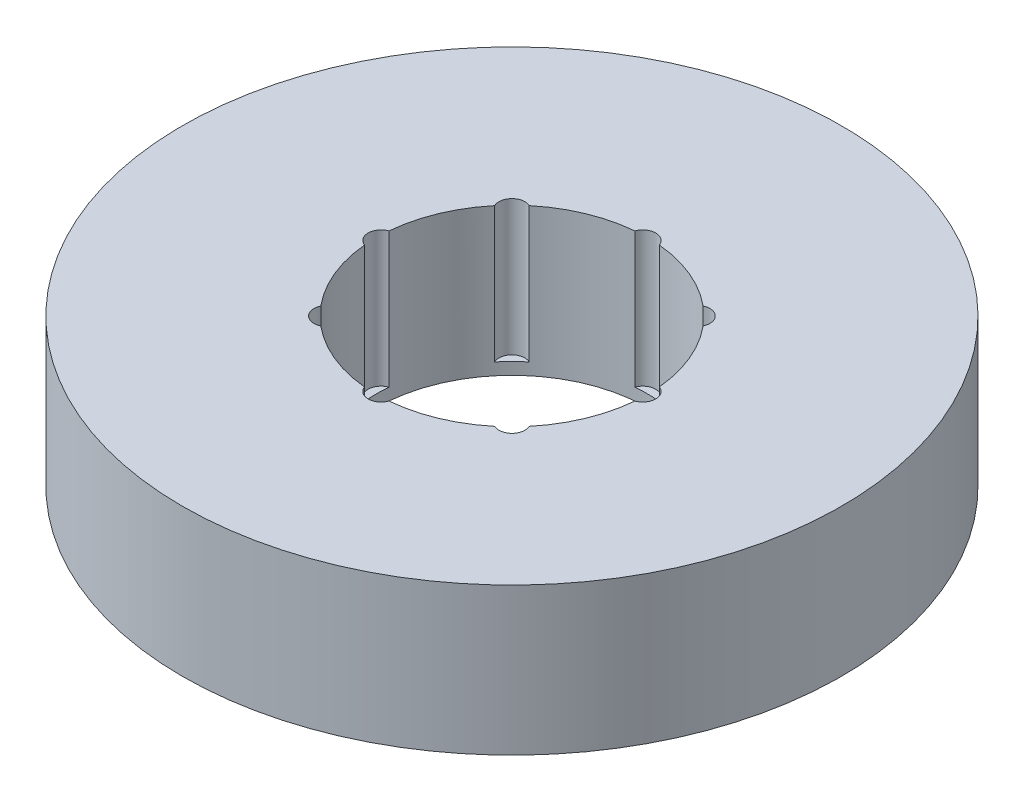
ISO-10303-21;
HEADER;
FILE_DESCRIPTION(('STEP AP214'),'2;1');
FILE_NAME('part.step','',(''),(''),'','','');
FILE_SCHEMA(('AUTOMOTIVE_DESIGN { 1 0 10303 214 1 1 1 1 }'));
ENDSEC;
DATA;
#1=APPLICATION_CONTEXT('core data for automotive mechanical design processes');
#2=APPLICATION_PROTOCOL_DEFINITION('international standard','automotive_design',2000,#1);
#3=PRODUCT_CONTEXT('',#1,'mechanical');
#4=PRODUCT('Part','Part','',(#3));
#5=PRODUCT_RELATED_PRODUCT_CATEGORY('part','',(#4));
#6=PRODUCT_DEFINITION_FORMATION('','',#4);
#7=PRODUCT_DEFINITION_CONTEXT('part definition',#1,'design');
#8=PRODUCT_DEFINITION('design','',#6,#7);
#9=PRODUCT_DEFINITION_SHAPE('','',#8);
#10=(LENGTH_UNIT() NAMED_UNIT(*) SI_UNIT(.MILLI.,.METRE.));
#11=(NAMED_UNIT(*) PLANE_ANGLE_UNIT() SI_UNIT($,.RADIAN.));
#12=(NAMED_UNIT(*) SI_UNIT($,.STERADIAN.) SOLID_ANGLE_UNIT());
#13=UNCERTAINTY_MEASURE_WITH_UNIT(LENGTH_MEASURE(1.E-05),#10,'distance_accuracy_value','');
#14=(GEOMETRIC_REPRESENTATION_CONTEXT(3) GLOBAL_UNCERTAINTY_ASSIGNED_CONTEXT((#13)) GLOBAL_UNIT_ASSIGNED_CONTEXT((#10,
#11,#12)) REPRESENTATION_CONTEXT('',''));
#15=CARTESIAN_POINT('',(0.,0.,0.));
#16=DIRECTION('',(0.,0.,1.));
#17=DIRECTION('',(1.,0.,0.));
#18=AXIS2_PLACEMENT_3D('',#15,#16,#17);
#19=CARTESIAN_POINT('',(0.,19.,0.));
#20=DIRECTION('',(0.,-1.,0.));
#21=DIRECTION('',(0.,0.,-1.));
#22=AXIS2_PLACEMENT_3D('',#19,#20,#21);
#23=CYLINDRICAL_SURFACE('',#22,42.5);
#24=CARTESIAN_POINT('',(0.,19.,0.));
#25=DIRECTION('',(0.,1.,0.));
#26=DIRECTION('',(0.,0.,1.));
#27=AXIS2_PLACEMENT_3D('',#24,#25,#26);
#28=CIRCLE('',#27,42.5);
#29=CARTESIAN_POINT('',(0.,19.,42.5));
#30=VERTEX_POINT('',#29);
#31=EDGE_CURVE('E183',#30,#30,#28,.T.);
#32=ORIENTED_EDGE('',*,*,#31,.F.);
#33=EDGE_LOOP('',(#32));
#34=FACE_BOUND('',#33,.T.);
#35=CARTESIAN_POINT('',(0.,0.,0.));
#36=DIRECTION('',(0.,1.,0.));
#37=DIRECTION('',(0.,0.,1.));
#38=AXIS2_PLACEMENT_3D('',#35,#36,#37);
#39=CIRCLE('',#38,42.5);
#40=CARTESIAN_POINT('',(0.,0.,42.5));
#41=VERTEX_POINT('',#40);
#42=EDGE_CURVE('E182',#41,#41,#39,.T.);
#43=ORIENTED_EDGE('',*,*,#42,.T.);
#44=EDGE_LOOP('',(#43));
#45=FACE_BOUND('',#44,.T.);
#46=ADVANCED_FACE('F39',(#34,#45),#23,.T.);
#47=CARTESIAN_POINT('',(0.,19.,0.));
#48=DIRECTION('',(0.,1.,0.));
#49=DIRECTION('',(0.,0.,1.));
#50=AXIS2_PLACEMENT_3D('',#47,#48,#49);
#51=PLANE('',#50);
#52=CARTESIAN_POINT('',(0.,19.,16.8717868784613));
#53=DIRECTION('',(0.,1.,0.));
#54=DIRECTION('',(1.,0.,0.));
#55=AXIS2_PLACEMENT_3D('',#52,#53,#54);
#56=CIRCLE('',#55,1.66984205773275);
#57=CARTESIAN_POINT('',(-1.57410849968048,19.,17.4290614328837));
#58=VERTEX_POINT('',#57);
#59=CARTESIAN_POINT('',(1.5741084996806,19.,17.4290614328837));
#60=VERTEX_POINT('',#59);
#61=EDGE_CURVE('E256',#58,#60,#56,.T.);
#62=ORIENTED_EDGE('',*,*,#61,.F.);
#63=CARTESIAN_POINT('',(0.,19.,0.));
#64=DIRECTION('',(0.,1.,0.));
#65=DIRECTION('',(0.,0.,1.));
#66=AXIS2_PLACEMENT_3D('',#63,#64,#65);
#67=CIRCLE('',#66,17.5);
#68=CARTESIAN_POINT('',(-11.2111447344615,19.,13.4372703233565));
#69=VERTEX_POINT('',#68);
#70=EDGE_CURVE('E175',#69,#58,#67,.T.);
#71=ORIENTED_EDGE('',*,*,#70,.F.);
#72=CARTESIAN_POINT('',(-11.9301549124942,19.,11.9301549124942));
#73=DIRECTION('',(0.,1.,0.));
#74=DIRECTION('',(0.707106781186549,0.,0.707106781186546));
#75=AXIS2_PLACEMENT_3D('',#72,#73,#74);
#76=CIRCLE('',#75,1.66984205773275);
#77=CARTESIAN_POINT('',(-13.4372703233565,19.,11.2111447344615));
#78=VERTEX_POINT('',#77);
#79=EDGE_CURVE('E152',#78,#69,#76,.T.);
#80=ORIENTED_EDGE('',*,*,#79,.F.);
#81=CARTESIAN_POINT('',(-17.4290614328837,19.,1.57410849968054));
#82=VERTEX_POINT('',#81);
#83=EDGE_CURVE('E168',#82,#78,#67,.T.);
#84=ORIENTED_EDGE('',*,*,#83,.F.);
#85=CARTESIAN_POINT('',(-16.8717868784613,19.,0.));
#86=DIRECTION('',(0.,1.,0.));
#87=DIRECTION('',(0.,0.,1.));
#88=AXIS2_PLACEMENT_3D('',#85,#86,#87);
#89=CIRCLE('',#88,1.66984205773275);
#90=CARTESIAN_POINT('',(-17.4290614328837,19.,-1.57410849968054));
#91=VERTEX_POINT('',#90);
#92=EDGE_CURVE('E205',#91,#82,#89,.T.);
#93=ORIENTED_EDGE('',*,*,#92,.F.);
#94=CARTESIAN_POINT('',(-13.4372703233566,19.,-11.2111447344613));
#95=VERTEX_POINT('',#94);
#96=EDGE_CURVE('E181',#95,#91,#67,.T.);
#97=ORIENTED_EDGE('',*,*,#96,.F.);
#98=CARTESIAN_POINT('',(-11.9301549124944,19.,-11.9301549124941));
#99=DIRECTION('',(0.,1.,0.));
#100=DIRECTION('',(-0.707106781186539,0.,0.707106781186556));
#101=AXIS2_PLACEMENT_3D('',#98,#99,#100);
#102=CIRCLE('',#101,1.66984205773275);
#103=CARTESIAN_POINT('',(-11.2111447344617,19.,-13.4372703233563));
#104=VERTEX_POINT('',#103);
#105=EDGE_CURVE('E453',#104,#95,#102,.T.);
#106=ORIENTED_EDGE('',*,*,#105,.F.);
#107=CARTESIAN_POINT('',(-1.57410849968072,19.,-17.4290614328837));
#108=VERTEX_POINT('',#107);
#109=EDGE_CURVE('E189',#108,#104,#67,.T.);
#110=ORIENTED_EDGE('',*,*,#109,.F.);
#111=CARTESIAN_POINT('',(-1.76722587117259E-13,19.,-16.8717868784613));
#112=DIRECTION('',(0.,1.,0.));
#113=DIRECTION('',(-1.,0.,0.));
#114=AXIS2_PLACEMENT_3D('',#111,#112,#113);
#115=CIRCLE('',#114,1.66984205773275);
#116=CARTESIAN_POINT('',(1.57410849968036,19.,-17.4290614328837));
#117=VERTEX_POINT('',#116);
#118=EDGE_CURVE('E462',#117,#108,#115,.T.);
#119=ORIENTED_EDGE('',*,*,#118,.F.);
#120=CARTESIAN_POINT('',(11.2111447344614,19.,-13.4372703233566));
#121=VERTEX_POINT('',#120);
#122=EDGE_CURVE('E197',#121,#117,#67,.T.);
#123=ORIENTED_EDGE('',*,*,#122,.F.);
#124=CARTESIAN_POINT('',(11.9301549124941,19.,-11.9301549124943));
#125=DIRECTION('',(0.,1.,0.));
#126=DIRECTION('',(-0.707106781186554,0.,-0.707106781186541));
#127=AXIS2_PLACEMENT_3D('',#124,#125,#126);
#128=CIRCLE('',#127,1.66984205773275);
#129=CARTESIAN_POINT('',(13.4372703233564,19.,-11.2111447344616));
#130=VERTEX_POINT('',#129);
#131=EDGE_CURVE('E470',#130,#121,#128,.T.);
#132=ORIENTED_EDGE('',*,*,#131,.F.);
#133=CARTESIAN_POINT('',(17.4290614328837,19.,-1.57410849968054));
#134=VERTEX_POINT('',#133);
#135=EDGE_CURVE('E489',#134,#130,#67,.T.);
#136=ORIENTED_EDGE('',*,*,#135,.F.);
#137=CARTESIAN_POINT('',(16.8717868784613,19.,0.));
#138=DIRECTION('',(0.,1.,0.));
#139=DIRECTION('',(0.,0.,-1.));
#140=AXIS2_PLACEMENT_3D('',#137,#138,#139);
#141=CIRCLE('',#140,1.66984205773275);
#142=CARTESIAN_POINT('',(17.4290614328837,19.,1.57410849968054));
#143=VERTEX_POINT('',#142);
#144=EDGE_CURVE('E476',#143,#134,#141,.T.);
#145=ORIENTED_EDGE('',*,*,#144,.F.);
#146=CARTESIAN_POINT('',(13.4372703233565,19.,11.2111447344614));
#147=VERTEX_POINT('',#146);
#148=EDGE_CURVE('E491',#147,#143,#67,.T.);
#149=ORIENTED_EDGE('',*,*,#148,.F.);
#150=CARTESIAN_POINT('',(11.9301549124943,19.,11.9301549124942));
#151=DIRECTION('',(0.,1.,0.));
#152=DIRECTION('',(0.707106781186544,0.,-0.707106781186551));
#153=AXIS2_PLACEMENT_3D('',#150,#151,#152);
#154=CIRCLE('',#153,1.66984205773275);
#155=CARTESIAN_POINT('',(11.2111447344616,19.,13.4372703233564));
#156=VERTEX_POINT('',#155);
#157=EDGE_CURVE('E475',#156,#147,#154,.T.);
#158=ORIENTED_EDGE('',*,*,#157,.F.);
#159=EDGE_CURVE('E190',#60,#156,#67,.T.);
#160=ORIENTED_EDGE('',*,*,#159,.F.);
#161=EDGE_LOOP('',(#62,#71,#80,#84,#93,#97,#106,#110,#119,#123,#132,#136,#145,#149,#158,#160));
#162=FACE_BOUND('',#161,.T.);
#163=ORIENTED_EDGE('',*,*,#31,.T.);
#164=EDGE_LOOP('',(#163));
#165=FACE_BOUND('',#164,.T.);
#166=ADVANCED_FACE('F170',(#162,#165),#51,.T.);
#167=CARTESIAN_POINT('',(0.,0.,0.));
#168=DIRECTION('',(0.,1.,0.));
#169=DIRECTION('',(0.,0.,1.));
#170=AXIS2_PLACEMENT_3D('',#167,#168,#169);
#171=PLANE('',#170);
#172=CARTESIAN_POINT('',(0.,0.,0.));
#173=DIRECTION('',(0.,1.,0.));
#174=DIRECTION('',(0.,0.,1.));
#175=AXIS2_PLACEMENT_3D('',#172,#173,#174);
#176=CIRCLE('',#175,17.5);
#177=CARTESIAN_POINT('',(0.,0.,17.5));
#178=VERTEX_POINT('',#177);
#179=EDGE_CURVE('E191',#178,#178,#176,.T.);
#180=ORIENTED_EDGE('',*,*,#179,.T.);
#181=EDGE_LOOP('',(#180));
#182=FACE_BOUND('',#181,.T.);
#183=ORIENTED_EDGE('',*,*,#42,.F.);
#184=EDGE_LOOP('',(#183));
#185=FACE_BOUND('',#184,.T.);
#186=ADVANCED_FACE('F277',(#182,#185),#171,.F.);
#187=CARTESIAN_POINT('',(0.,19.,0.));
#188=DIRECTION('',(0.,-1.,0.));
#189=DIRECTION('',(0.,0.,-1.));
#190=AXIS2_PLACEMENT_3D('',#187,#188,#189);
#191=CYLINDRICAL_SURFACE('',#190,17.5);
#192=DIRECTION('',(0.,1.,0.));
#193=VECTOR('',#192,1.);
#194=CARTESIAN_POINT('',(-1.57410849968048,10.2730110623013,17.4290614328837));
#195=LINE('',#194,#193);
#196=CARTESIAN_POINT('',(-1.57410849968048,1.54602212460251,17.4290614328837));
#197=VERTEX_POINT('',#196);
#198=EDGE_CURVE('E11',#197,#58,#195,.T.);
#199=ORIENTED_EDGE('',*,*,#198,.F.);
#200=CARTESIAN_POINT('',(0.,1.54602212460251,0.));
#201=DIRECTION('',(0.,1.,0.));
#202=DIRECTION('',(0.,0.,1.));
#203=AXIS2_PLACEMENT_3D('',#200,#201,#202);
#204=CIRCLE('',#203,17.5);
#205=CARTESIAN_POINT('',(1.5741084996806,1.54602212460251,17.4290614328837));
#206=VERTEX_POINT('',#205);
#207=EDGE_CURVE('E251',#197,#206,#204,.T.);
#208=ORIENTED_EDGE('',*,*,#207,.T.);
#209=DIRECTION('',(0.,1.,0.));
#210=VECTOR('',#209,1.);
#211=CARTESIAN_POINT('',(1.5741084996806,10.2730110623013,17.4290614328837));
#212=LINE('',#211,#210);
#213=EDGE_CURVE('E46',#60,#206,#212,.F.);
#214=ORIENTED_EDGE('',*,*,#213,.F.);
#215=ORIENTED_EDGE('',*,*,#159,.T.);
#216=DIRECTION('',(0.,1.,0.));
#217=VECTOR('',#216,1.);
#218=CARTESIAN_POINT('',(11.2111447344616,10.2730110623013,13.4372703233564));
#219=LINE('',#218,#217);
#220=CARTESIAN_POINT('',(11.2111447344616,1.54602212460251,13.4372703233564));
#221=VERTEX_POINT('',#220);
#222=EDGE_CURVE('E253',#221,#156,#219,.T.);
#223=ORIENTED_EDGE('',*,*,#222,.F.);
#224=CARTESIAN_POINT('',(0.,1.54602212460251,0.));
#225=DIRECTION('',(0.,1.,0.));
#226=DIRECTION('',(0.,0.,1.));
#227=AXIS2_PLACEMENT_3D('',#224,#225,#226);
#228=CIRCLE('',#227,17.5);
#229=CARTESIAN_POINT('',(13.4372703233565,1.54602212460251,11.2111447344614));
#230=VERTEX_POINT('',#229);
#231=EDGE_CURVE('E246',#221,#230,#228,.T.);
#232=ORIENTED_EDGE('',*,*,#231,.T.);
#233=DIRECTION('',(0.,1.,0.));
#234=VECTOR('',#233,1.);
#235=CARTESIAN_POINT('',(13.4372703233565,10.2730110623013,11.2111447344614));
#236=LINE('',#235,#234);
#237=EDGE_CURVE('E248',#147,#230,#236,.F.);
#238=ORIENTED_EDGE('',*,*,#237,.F.);
#239=ORIENTED_EDGE('',*,*,#148,.T.);
#240=DIRECTION('',(0.,1.,0.));
#241=VECTOR('',#240,1.);
#242=CARTESIAN_POINT('',(17.4290614328837,10.2730110623013,1.57410849968054));
#243=LINE('',#242,#241);
#244=CARTESIAN_POINT('',(17.4290614328837,1.54602212460251,1.57410849968054));
#245=VERTEX_POINT('',#244);
#246=EDGE_CURVE('E243',#245,#143,#243,.T.);
#247=ORIENTED_EDGE('',*,*,#246,.F.);
#248=CARTESIAN_POINT('',(0.,1.54602212460251,0.));
#249=DIRECTION('',(0.,1.,0.));
#250=DIRECTION('',(0.,0.,1.));
#251=AXIS2_PLACEMENT_3D('',#248,#249,#250);
#252=CIRCLE('',#251,17.5);
#253=CARTESIAN_POINT('',(17.4290614328837,1.54602212460251,-1.57410849968054));
#254=VERTEX_POINT('',#253);
#255=EDGE_CURVE('E236',#245,#254,#252,.T.);
#256=ORIENTED_EDGE('',*,*,#255,.T.);
#257=DIRECTION('',(0.,1.,0.));
#258=VECTOR('',#257,1.);
#259=CARTESIAN_POINT('',(17.4290614328837,10.2730110623013,-1.57410849968054));
#260=LINE('',#259,#258);
#261=EDGE_CURVE('E241',#134,#254,#260,.F.);
#262=ORIENTED_EDGE('',*,*,#261,.F.);
#263=ORIENTED_EDGE('',*,*,#135,.T.);
#264=DIRECTION('',(0.,1.,0.));
#265=VECTOR('',#264,1.);
#266=CARTESIAN_POINT('',(13.4372703233564,10.2730110623013,-11.2111447344616));
#267=LINE('',#266,#265);
#268=CARTESIAN_POINT('',(13.4372703233564,1.54602212460251,-11.2111447344616));
#269=VERTEX_POINT('',#268);
#270=EDGE_CURVE('E237',#269,#130,#267,.T.);
#271=ORIENTED_EDGE('',*,*,#270,.F.);
#272=CARTESIAN_POINT('',(0.,1.54602212460251,0.));
#273=DIRECTION('',(0.,1.,0.));
#274=DIRECTION('',(0.,0.,1.));
#275=AXIS2_PLACEMENT_3D('',#272,#273,#274);
#276=CIRCLE('',#275,17.5);
#277=CARTESIAN_POINT('',(11.2111447344614,1.54602212460251,-13.4372703233566));
#278=VERTEX_POINT('',#277);
#279=EDGE_CURVE('E229',#269,#278,#276,.T.);
#280=ORIENTED_EDGE('',*,*,#279,.T.);
#281=DIRECTION('',(0.,1.,0.));
#282=VECTOR('',#281,1.);
#283=CARTESIAN_POINT('',(11.2111447344614,10.2730110623013,-13.4372703233566));
#284=LINE('',#283,#282);
#285=EDGE_CURVE('E232',#121,#278,#284,.F.);
#286=ORIENTED_EDGE('',*,*,#285,.F.);
#287=ORIENTED_EDGE('',*,*,#122,.T.);
#288=DIRECTION('',(0.,1.,0.));
#289=VECTOR('',#288,1.);
#290=CARTESIAN_POINT('',(1.57410849968036,10.2730110623013,-17.4290614328837));
#291=LINE('',#290,#289);
#292=CARTESIAN_POINT('',(1.57410849968036,1.54602212460251,-17.4290614328837));
#293=VERTEX_POINT('',#292);
#294=EDGE_CURVE('E227',#293,#117,#291,.T.);
#295=ORIENTED_EDGE('',*,*,#294,.F.);
#296=CARTESIAN_POINT('',(0.,1.54602212460251,0.));
#297=DIRECTION('',(0.,1.,0.));
#298=DIRECTION('',(0.,0.,1.));
#299=AXIS2_PLACEMENT_3D('',#296,#297,#298);
#300=CIRCLE('',#299,17.5);
#301=CARTESIAN_POINT('',(-1.57410849968072,1.54602212460251,-17.4290614328837));
#302=VERTEX_POINT('',#301);
#303=EDGE_CURVE('E225',#293,#302,#300,.T.);
#304=ORIENTED_EDGE('',*,*,#303,.T.);
#305=DIRECTION('',(0.,1.,0.));
#306=VECTOR('',#305,1.);
#307=CARTESIAN_POINT('',(-1.57410849968072,10.2730110623013,-17.4290614328837));
#308=LINE('',#307,#306);
#309=EDGE_CURVE('E223',#108,#302,#308,.F.);
#310=ORIENTED_EDGE('',*,*,#309,.F.);
#311=ORIENTED_EDGE('',*,*,#109,.T.);
#312=DIRECTION('',(0.,1.,0.));
#313=VECTOR('',#312,1.);
#314=CARTESIAN_POINT('',(-11.2111447344617,10.2730110623013,-13.4372703233563));
#315=LINE('',#314,#313);
#316=CARTESIAN_POINT('',(-11.2111447344617,1.54602212460251,-13.4372703233563));
#317=VERTEX_POINT('',#316);
#318=EDGE_CURVE('E219',#317,#104,#315,.T.);
#319=ORIENTED_EDGE('',*,*,#318,.F.);
#320=CARTESIAN_POINT('',(0.,1.54602212460251,0.));
#321=DIRECTION('',(0.,1.,0.));
#322=DIRECTION('',(0.,0.,1.));
#323=AXIS2_PLACEMENT_3D('',#320,#321,#322);
#324=CIRCLE('',#323,17.5);
#325=CARTESIAN_POINT('',(-13.4372703233566,1.54602212460251,-11.2111447344613));
#326=VERTEX_POINT('',#325);
#327=EDGE_CURVE('E159',#317,#326,#324,.T.);
#328=ORIENTED_EDGE('',*,*,#327,.T.);
#329=DIRECTION('',(0.,1.,0.));
#330=VECTOR('',#329,1.);
#331=CARTESIAN_POINT('',(-13.4372703233566,10.2730110623013,-11.2111447344613));
#332=LINE('',#331,#330);
#333=EDGE_CURVE('E220',#95,#326,#332,.F.);
#334=ORIENTED_EDGE('',*,*,#333,.F.);
#335=ORIENTED_EDGE('',*,*,#96,.T.);
#336=DIRECTION('',(0.,1.,0.));
#337=VECTOR('',#336,1.);
#338=CARTESIAN_POINT('',(-17.4290614328837,10.2730110623013,-1.57410849968054));
#339=LINE('',#338,#337);
#340=CARTESIAN_POINT('',(-17.4290614328837,1.54602212460251,-1.57410849968054));
#341=VERTEX_POINT('',#340);
#342=EDGE_CURVE('E209',#341,#91,#339,.T.);
#343=ORIENTED_EDGE('',*,*,#342,.F.);
#344=CARTESIAN_POINT('',(0.,1.54602212460251,0.));
#345=DIRECTION('',(0.,1.,0.));
#346=DIRECTION('',(0.,0.,1.));
#347=AXIS2_PLACEMENT_3D('',#344,#345,#346);
#348=CIRCLE('',#347,17.5);
#349=CARTESIAN_POINT('',(-17.4290614328837,1.54602212460251,1.57410849968054));
#350=VERTEX_POINT('',#349);
#351=EDGE_CURVE('E206',#341,#350,#348,.T.);
#352=ORIENTED_EDGE('',*,*,#351,.T.);
#353=DIRECTION('',(0.,1.,0.));
#354=VECTOR('',#353,1.);
#355=CARTESIAN_POINT('',(-17.4290614328837,10.2730110623013,1.57410849968054));
#356=LINE('',#355,#354);
#357=EDGE_CURVE('E179',#82,#350,#356,.F.);
#358=ORIENTED_EDGE('',*,*,#357,.F.);
#359=ORIENTED_EDGE('',*,*,#83,.T.);
#360=DIRECTION('',(0.,1.,0.));
#361=VECTOR('',#360,1.);
#362=CARTESIAN_POINT('',(-13.4372703233565,10.2730110623013,11.2111447344615));
#363=LINE('',#362,#361);
#364=CARTESIAN_POINT('',(-13.4372703233565,1.54602212460251,11.2111447344615));
#365=VERTEX_POINT('',#364);
#366=EDGE_CURVE('E147',#365,#78,#363,.T.);
#367=ORIENTED_EDGE('',*,*,#366,.F.);
#368=CARTESIAN_POINT('',(0.,1.54602212460251,0.));
#369=DIRECTION('',(0.,1.,0.));
#370=DIRECTION('',(0.,0.,1.));
#371=AXIS2_PLACEMENT_3D('',#368,#369,#370);
#372=CIRCLE('',#371,17.5);
#373=CARTESIAN_POINT('',(-11.2111447344615,1.54602212460251,13.4372703233565));
#374=VERTEX_POINT('',#373);
#375=EDGE_CURVE('E215',#365,#374,#372,.T.);
#376=ORIENTED_EDGE('',*,*,#375,.T.);
#377=DIRECTION('',(0.,1.,0.));
#378=VECTOR('',#377,1.);
#379=CARTESIAN_POINT('',(-11.2111447344615,10.2730110623013,13.4372703233565));
#380=LINE('',#379,#378);
#381=EDGE_CURVE('E161',#69,#374,#380,.F.);
#382=ORIENTED_EDGE('',*,*,#381,.F.);
#383=ORIENTED_EDGE('',*,*,#70,.T.);
#384=EDGE_LOOP('',(#199,#208,#214,#215,#223,#232,#238,#239,#247,#256,#262,#263,#271,#280,#286,
#287,#295,#304,#310,#311,#319,#328,#334,#335,#343,#352,#358,#359,#367,#376,#382,#383));
#385=FACE_BOUND('',#384,.T.);
#386=ORIENTED_EDGE('',*,*,#179,.F.);
#387=EDGE_LOOP('',(#386));
#388=FACE_BOUND('',#387,.T.);
#389=ADVANCED_FACE('F176',(#385,#388),#191,.F.);
#390=CARTESIAN_POINT('',(-16.8717868784613,1.54602212460251,0.));
#391=DIRECTION('',(0.,1.,0.));
#392=DIRECTION('',(0.,0.,1.));
#393=AXIS2_PLACEMENT_3D('',#390,#391,#392);
#394=CYLINDRICAL_SURFACE('',#393,1.66984205773275);
#395=ORIENTED_EDGE('',*,*,#342,.T.);
#396=ORIENTED_EDGE('',*,*,#92,.T.);
#397=ORIENTED_EDGE('',*,*,#357,.T.);
#398=CARTESIAN_POINT('',(-16.8717868784613,1.54602212460251,0.));
#399=DIRECTION('',(0.,1.,0.));
#400=DIRECTION('',(0.,0.,1.));
#401=AXIS2_PLACEMENT_3D('',#398,#399,#400);
#402=CIRCLE('',#401,1.66984205773275);
#403=EDGE_CURVE('E200',#341,#350,#402,.T.);
#404=ORIENTED_EDGE('',*,*,#403,.F.);
#405=EDGE_LOOP('',(#395,#396,#397,#404));
#406=FACE_BOUND('',#405,.T.);
#407=ADVANCED_FACE('F286',(#406),#394,.F.);
#408=CARTESIAN_POINT('',(-16.8717868784613,1.54602212460251,0.));
#409=DIRECTION('',(0.,1.,0.));
#410=DIRECTION('',(0.,0.,1.));
#411=AXIS2_PLACEMENT_3D('',#408,#409,#410);
#412=PLANE('',#411);
#413=ORIENTED_EDGE('',*,*,#403,.T.);
#414=ORIENTED_EDGE('',*,*,#351,.F.);
#415=EDGE_LOOP('',(#413,#414));
#416=FACE_BOUND('',#415,.T.);
#417=ADVANCED_FACE('F289',(#416),#412,.T.);
#418=CARTESIAN_POINT('',(-11.9301549124942,1.54602212460251,11.9301549124942));
#419=DIRECTION('',(0.,1.,0.));
#420=DIRECTION('',(0.,0.,1.));
#421=AXIS2_PLACEMENT_3D('',#418,#419,#420);
#422=CYLINDRICAL_SURFACE('',#421,1.66984205773275);
#423=ORIENTED_EDGE('',*,*,#366,.T.);
#424=ORIENTED_EDGE('',*,*,#79,.T.);
#425=ORIENTED_EDGE('',*,*,#381,.T.);
#426=CARTESIAN_POINT('',(-11.9301549124942,1.54602212460251,11.9301549124942));
#427=DIRECTION('',(0.,1.,0.));
#428=DIRECTION('',(0.707106781186549,0.,0.707106781186546));
#429=AXIS2_PLACEMENT_3D('',#426,#427,#428);
#430=CIRCLE('',#429,1.66984205773275);
#431=EDGE_CURVE('E156',#365,#374,#430,.T.);
#432=ORIENTED_EDGE('',*,*,#431,.F.);
#433=EDGE_LOOP('',(#423,#424,#425,#432));
#434=FACE_BOUND('',#433,.T.);
#435=ADVANCED_FACE('F155',(#434),#422,.F.);
#436=CARTESIAN_POINT('',(-11.9301549124942,1.54602212460251,11.9301549124942));
#437=DIRECTION('',(0.,1.,0.));
#438=DIRECTION('',(0.707106781186549,0.,0.707106781186546));
#439=AXIS2_PLACEMENT_3D('',#436,#437,#438);
#440=PLANE('',#439);
#441=ORIENTED_EDGE('',*,*,#431,.T.);
#442=ORIENTED_EDGE('',*,*,#375,.F.);
#443=EDGE_LOOP('',(#441,#442));
#444=FACE_BOUND('',#443,.T.);
#445=ADVANCED_FACE('F300',(#444),#440,.T.);
#446=CARTESIAN_POINT('',(-11.9301549124944,1.54602212460251,-11.9301549124941));
#447=DIRECTION('',(0.,1.,0.));
#448=DIRECTION('',(0.,0.,1.));
#449=AXIS2_PLACEMENT_3D('',#446,#447,#448);
#450=CYLINDRICAL_SURFACE('',#449,1.66984205773275);
#451=ORIENTED_EDGE('',*,*,#318,.T.);
#452=ORIENTED_EDGE('',*,*,#105,.T.);
#453=ORIENTED_EDGE('',*,*,#333,.T.);
#454=CARTESIAN_POINT('',(-11.9301549124944,1.54602212460251,-11.9301549124941));
#455=DIRECTION('',(0.,1.,0.));
#456=DIRECTION('',(-0.707106781186539,0.,0.707106781186556));
#457=AXIS2_PLACEMENT_3D('',#454,#455,#456);
#458=CIRCLE('',#457,1.66984205773275);
#459=EDGE_CURVE('E454',#317,#326,#458,.T.);
#460=ORIENTED_EDGE('',*,*,#459,.F.);
#461=EDGE_LOOP('',(#451,#452,#453,#460));
#462=FACE_BOUND('',#461,.T.);
#463=ADVANCED_FACE('F299',(#462),#450,.F.);
#464=CARTESIAN_POINT('',(-11.9301549124944,1.54602212460251,-11.9301549124941));
#465=DIRECTION('',(0.,1.,0.));
#466=DIRECTION('',(-0.707106781186539,0.,0.707106781186556));
#467=AXIS2_PLACEMENT_3D('',#464,#465,#466);
#468=PLANE('',#467);
#469=ORIENTED_EDGE('',*,*,#459,.T.);
#470=ORIENTED_EDGE('',*,*,#327,.F.);
#471=EDGE_LOOP('',(#469,#470));
#472=FACE_BOUND('',#471,.T.);
#473=ADVANCED_FACE('F379',(#472),#468,.T.);
#474=CARTESIAN_POINT('',(-1.76722587117259E-13,1.54602212460251,-16.8717868784613));
#475=DIRECTION('',(0.,1.,0.));
#476=DIRECTION('',(0.,0.,1.));
#477=AXIS2_PLACEMENT_3D('',#474,#475,#476);
#478=CYLINDRICAL_SURFACE('',#477,1.66984205773275);
#479=ORIENTED_EDGE('',*,*,#294,.T.);
#480=ORIENTED_EDGE('',*,*,#118,.T.);
#481=ORIENTED_EDGE('',*,*,#309,.T.);
#482=CARTESIAN_POINT('',(-1.76722587117259E-13,1.54602212460251,-16.8717868784613));
#483=DIRECTION('',(0.,1.,0.));
#484=DIRECTION('',(-1.,0.,0.));
#485=AXIS2_PLACEMENT_3D('',#482,#483,#484);
#486=CIRCLE('',#485,1.66984205773275);
#487=EDGE_CURVE('E465',#293,#302,#486,.T.);
#488=ORIENTED_EDGE('',*,*,#487,.F.);
#489=EDGE_LOOP('',(#479,#480,#481,#488));
#490=FACE_BOUND('',#489,.T.);
#491=ADVANCED_FACE('F371',(#490),#478,.F.);
#492=CARTESIAN_POINT('',(-1.76722587117259E-13,1.54602212460251,-16.8717868784613));
#493=DIRECTION('',(0.,1.,0.));
#494=DIRECTION('',(-1.,0.,0.));
#495=AXIS2_PLACEMENT_3D('',#492,#493,#494);
#496=PLANE('',#495);
#497=ORIENTED_EDGE('',*,*,#487,.T.);
#498=ORIENTED_EDGE('',*,*,#303,.F.);
#499=EDGE_LOOP('',(#497,#498));
#500=FACE_BOUND('',#499,.T.);
#501=ADVANCED_FACE('F308',(#500),#496,.T.);
#502=CARTESIAN_POINT('',(11.9301549124941,1.54602212460251,-11.9301549124943));
#503=DIRECTION('',(0.,1.,0.));
#504=DIRECTION('',(0.,0.,1.));
#505=AXIS2_PLACEMENT_3D('',#502,#503,#504);
#506=CYLINDRICAL_SURFACE('',#505,1.66984205773275);
#507=ORIENTED_EDGE('',*,*,#270,.T.);
#508=ORIENTED_EDGE('',*,*,#131,.T.);
#509=ORIENTED_EDGE('',*,*,#285,.T.);
#510=CARTESIAN_POINT('',(11.9301549124941,1.54602212460251,-11.9301549124943));
#511=DIRECTION('',(0.,1.,0.));
#512=DIRECTION('',(-0.707106781186554,0.,-0.707106781186541));
#513=AXIS2_PLACEMENT_3D('',#510,#511,#512);
#514=CIRCLE('',#513,1.66984205773275);
#515=EDGE_CURVE('E477',#269,#278,#514,.T.);
#516=ORIENTED_EDGE('',*,*,#515,.F.);
#517=EDGE_LOOP('',(#507,#508,#509,#516));
#518=FACE_BOUND('',#517,.T.);
#519=ADVANCED_FACE('F305',(#518),#506,.F.);
#520=CARTESIAN_POINT('',(11.9301549124941,1.54602212460251,-11.9301549124943));
#521=DIRECTION('',(0.,1.,0.));
#522=DIRECTION('',(-0.707106781186554,0.,-0.707106781186541));
#523=AXIS2_PLACEMENT_3D('',#520,#521,#522);
#524=PLANE('',#523);
#525=ORIENTED_EDGE('',*,*,#515,.T.);
#526=ORIENTED_EDGE('',*,*,#279,.F.);
#527=EDGE_LOOP('',(#525,#526));
#528=FACE_BOUND('',#527,.T.);
#529=ADVANCED_FACE('F304',(#528),#524,.T.);
#530=CARTESIAN_POINT('',(16.8717868784613,1.54602212460251,0.));
#531=DIRECTION('',(0.,1.,0.));
#532=DIRECTION('',(0.,0.,1.));
#533=AXIS2_PLACEMENT_3D('',#530,#531,#532);
#534=CYLINDRICAL_SURFACE('',#533,1.66984205773275);
#535=ORIENTED_EDGE('',*,*,#246,.T.);
#536=ORIENTED_EDGE('',*,*,#144,.T.);
#537=ORIENTED_EDGE('',*,*,#261,.T.);
#538=CARTESIAN_POINT('',(16.8717868784613,1.54602212460251,0.));
#539=DIRECTION('',(0.,1.,0.));
#540=DIRECTION('',(0.,0.,-1.));
#541=AXIS2_PLACEMENT_3D('',#538,#539,#540);
#542=CIRCLE('',#541,1.66984205773275);
#543=EDGE_CURVE('E478',#245,#254,#542,.T.);
#544=ORIENTED_EDGE('',*,*,#543,.F.);
#545=EDGE_LOOP('',(#535,#536,#537,#544));
#546=FACE_BOUND('',#545,.T.);
#547=ADVANCED_FACE('F309',(#546),#534,.F.);
#548=CARTESIAN_POINT('',(16.8717868784613,1.54602212460251,0.));
#549=DIRECTION('',(0.,1.,0.));
#550=DIRECTION('',(0.,0.,-1.));
#551=AXIS2_PLACEMENT_3D('',#548,#549,#550);
#552=PLANE('',#551);
#553=ORIENTED_EDGE('',*,*,#543,.T.);
#554=ORIENTED_EDGE('',*,*,#255,.F.);
#555=EDGE_LOOP('',(#553,#554));
#556=FACE_BOUND('',#555,.T.);
#557=ADVANCED_FACE('F314',(#556),#552,.T.);
#558=CARTESIAN_POINT('',(11.9301549124943,1.54602212460251,11.9301549124942));
#559=DIRECTION('',(0.,1.,0.));
#560=DIRECTION('',(0.,0.,1.));
#561=AXIS2_PLACEMENT_3D('',#558,#559,#560);
#562=CYLINDRICAL_SURFACE('',#561,1.66984205773275);
#563=ORIENTED_EDGE('',*,*,#222,.T.);
#564=ORIENTED_EDGE('',*,*,#157,.T.);
#565=ORIENTED_EDGE('',*,*,#237,.T.);
#566=CARTESIAN_POINT('',(11.9301549124943,1.54602212460251,11.9301549124942));
#567=DIRECTION('',(0.,1.,0.));
#568=DIRECTION('',(0.707106781186544,0.,-0.707106781186551));
#569=AXIS2_PLACEMENT_3D('',#566,#567,#568);
#570=CIRCLE('',#569,1.66984205773275);
#571=EDGE_CURVE('E56',#221,#230,#570,.T.);
#572=ORIENTED_EDGE('',*,*,#571,.F.);
#573=EDGE_LOOP('',(#563,#564,#565,#572));
#574=FACE_BOUND('',#573,.T.);
#575=ADVANCED_FACE('F318',(#574),#562,.F.);
#576=CARTESIAN_POINT('',(11.9301549124943,1.54602212460251,11.9301549124942));
#577=DIRECTION('',(0.,1.,0.));
#578=DIRECTION('',(0.707106781186544,0.,-0.707106781186551));
#579=AXIS2_PLACEMENT_3D('',#576,#577,#578);
#580=PLANE('',#579);
#581=ORIENTED_EDGE('',*,*,#571,.T.);
#582=ORIENTED_EDGE('',*,*,#231,.F.);
#583=EDGE_LOOP('',(#581,#582));
#584=FACE_BOUND('',#583,.T.);
#585=ADVANCED_FACE('F270',(#584),#580,.T.);
#586=CARTESIAN_POINT('',(0.,1.54602212460251,16.8717868784613));
#587=DIRECTION('',(0.,1.,0.));
#588=DIRECTION('',(0.,0.,1.));
#589=AXIS2_PLACEMENT_3D('',#586,#587,#588);
#590=CYLINDRICAL_SURFACE('',#589,1.66984205773275);
#591=ORIENTED_EDGE('',*,*,#198,.T.);
#592=ORIENTED_EDGE('',*,*,#61,.T.);
#593=ORIENTED_EDGE('',*,*,#213,.T.);
#594=CARTESIAN_POINT('',(0.,1.54602212460251,16.8717868784613));
#595=DIRECTION('',(0.,1.,0.));
#596=DIRECTION('',(1.,0.,0.));
#597=AXIS2_PLACEMENT_3D('',#594,#595,#596);
#598=CIRCLE('',#597,1.66984205773275);
#599=EDGE_CURVE('E55',#197,#206,#598,.T.);
#600=ORIENTED_EDGE('',*,*,#599,.F.);
#601=EDGE_LOOP('',(#591,#592,#593,#600));
#602=FACE_BOUND('',#601,.T.);
#603=ADVANCED_FACE('F260',(#602),#590,.F.);
#604=CARTESIAN_POINT('',(0.,1.54602212460251,16.8717868784613));
#605=DIRECTION('',(0.,1.,0.));
#606=DIRECTION('',(1.,0.,0.));
#607=AXIS2_PLACEMENT_3D('',#604,#605,#606);
#608=PLANE('',#607);
#609=ORIENTED_EDGE('',*,*,#599,.T.);
#610=ORIENTED_EDGE('',*,*,#207,.F.);
#611=EDGE_LOOP('',(#609,#610));
#612=FACE_BOUND('',#611,.T.);
#613=ADVANCED_FACE('F261',(#612),#608,.T.);
#614=CLOSED_SHELL('',(#46,#166,#186,#389,#407,#417,#435,#445,#463,#473,#491,#501,#519,#529,#547,
#557,#575,#585,#603,#613));
#615=MANIFOLD_SOLID_BREP('B2',#614);
#616=ADVANCED_BREP_SHAPE_REPRESENTATION('',(#18,#615),#14);
#617=SHAPE_DEFINITION_REPRESENTATION(#9,#616);
ENDSEC;
END-ISO-10303-21;
